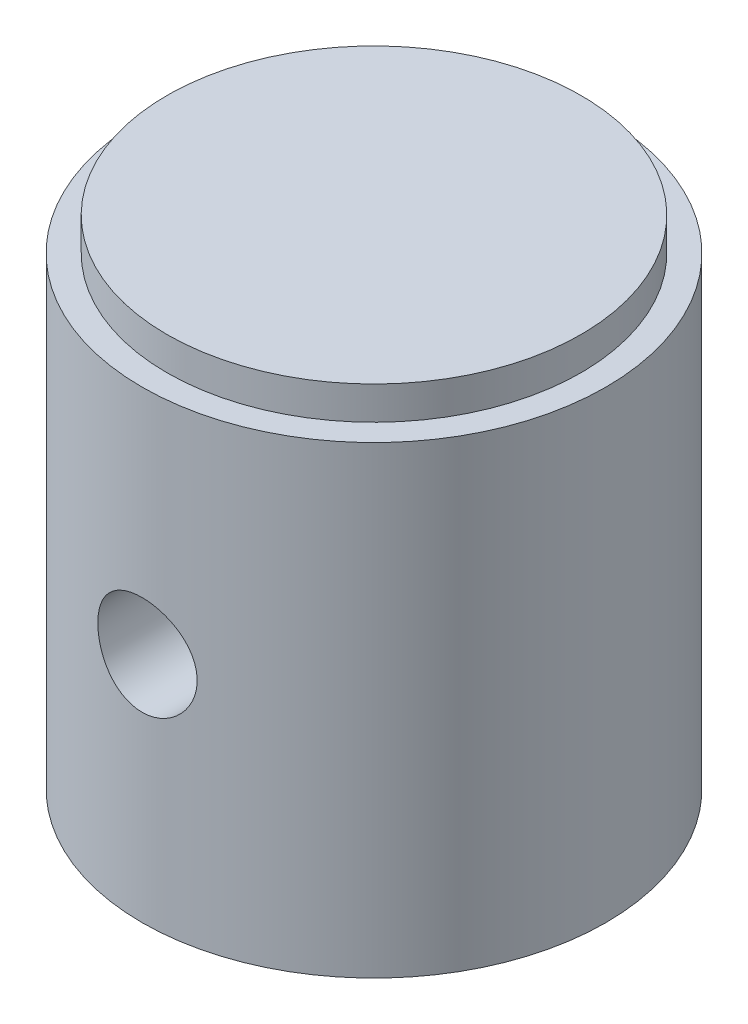
ISO-10303-21;
HEADER;
FILE_DESCRIPTION(('STEP AP214'),'2;1');
FILE_NAME('part.step','',(''),(''),'','','');
FILE_SCHEMA(('AUTOMOTIVE_DESIGN { 1 0 10303 214 1 1 1 1 }'));
ENDSEC;
DATA;
#1=APPLICATION_CONTEXT('core data for automotive mechanical design processes');
#2=APPLICATION_PROTOCOL_DEFINITION('international standard','automotive_design',2000,#1);
#3=PRODUCT_CONTEXT('',#1,'mechanical');
#4=PRODUCT('Part','Part','',(#3));
#5=PRODUCT_RELATED_PRODUCT_CATEGORY('part','',(#4));
#6=PRODUCT_DEFINITION_FORMATION('','',#4);
#7=PRODUCT_DEFINITION_CONTEXT('part definition',#1,'design');
#8=PRODUCT_DEFINITION('design','',#6,#7);
#9=PRODUCT_DEFINITION_SHAPE('','',#8);
#10=(LENGTH_UNIT() NAMED_UNIT(*) SI_UNIT(.MILLI.,.METRE.));
#11=(NAMED_UNIT(*) PLANE_ANGLE_UNIT() SI_UNIT($,.RADIAN.));
#12=(NAMED_UNIT(*) SI_UNIT($,.STERADIAN.) SOLID_ANGLE_UNIT());
#13=UNCERTAINTY_MEASURE_WITH_UNIT(LENGTH_MEASURE(1.E-05),#10,'distance_accuracy_value','');
#14=(GEOMETRIC_REPRESENTATION_CONTEXT(3) GLOBAL_UNCERTAINTY_ASSIGNED_CONTEXT((#13)) GLOBAL_UNIT_ASSIGNED_CONTEXT((#10,
#11,#12)) REPRESENTATION_CONTEXT('',''));
#15=CARTESIAN_POINT('',(0.,0.,0.));
#16=DIRECTION('',(0.,0.,1.));
#17=DIRECTION('',(1.,0.,0.));
#18=AXIS2_PLACEMENT_3D('',#15,#16,#17);
#19=CARTESIAN_POINT('',(0.,19.3671137438984,0.));
#20=DIRECTION('',(0.,1.,0.));
#21=DIRECTION('',(0.,0.,1.));
#22=AXIS2_PLACEMENT_3D('',#19,#20,#21);
#23=CYLINDRICAL_SURFACE('',#22,7.);
#24=CARTESIAN_POINT('',(0.,8.5,-7.));
#25=CARTESIAN_POINT('',(0.0832358860906166,8.4999971004257,-6.99999846043226));
#26=CARTESIAN_POINT('',(0.166507195600275,8.49304839161215,-6.9985002594971));
#27=CARTESIAN_POINT('',(0.330687344293327,8.46546434314641,-6.99266829827727));
#28=CARTESIAN_POINT('',(0.41159440357119,8.44481895580507,-6.98833245637099));
#29=CARTESIAN_POINT('',(0.568649323817737,8.39051563539196,-6.97730831788826));
#30=CARTESIAN_POINT('',(0.644801963446556,8.35687102061868,-6.97062242967171));
#31=CARTESIAN_POINT('',(0.790378177960788,8.27756591382874,-6.9556210681797));
#32=CARTESIAN_POINT('',(0.85980198174737,8.23190583075006,-6.9473056503666));
#33=CARTESIAN_POINT('',(0.99102479053523,8.12911970032649,-6.9298136924631));
#34=CARTESIAN_POINT('',(1.05270503419445,8.07184377810147,-6.92062683143259));
#35=CARTESIAN_POINT('',(1.16566042389435,7.9477736843148,-6.90250069814144));
#36=CARTESIAN_POINT('',(1.21693467150908,7.88097869174874,-6.8935614473163));
#37=CARTESIAN_POINT('',(1.30814204379808,7.73889424713957,-6.87684116047224));
#38=CARTESIAN_POINT('',(1.34794958335009,7.66352248224379,-6.8690733634436));
#39=CARTESIAN_POINT('',(1.41428823691148,7.50696554623316,-6.85572325558537));
#40=CARTESIAN_POINT('',(1.44082087001716,7.42578104150743,-6.8501406947071));
#41=CARTESIAN_POINT('',(1.47946574422454,7.26118891341193,-6.8418980892631));
#42=CARTESIAN_POINT('',(1.49178779748342,7.17783272433614,-6.83919556896486));
#43=CARTESIAN_POINT('',(1.50231395206577,7.01019576749301,-6.83689139845105));
#44=CARTESIAN_POINT('',(1.50051971664629,6.92591510982005,-6.83728938291729));
#45=CARTESIAN_POINT('',(1.48303326340861,6.76037531206621,-6.84110276603832));
#46=CARTESIAN_POINT('',(1.46758398649408,6.67908911089985,-6.84446541682162));
#47=CARTESIAN_POINT('',(1.42361054298677,6.52028975971066,-6.85374593375787));
#48=CARTESIAN_POINT('',(1.39508566936466,6.44277681396768,-6.85966393808402));
#49=CARTESIAN_POINT('',(1.32554551075991,6.29303712712666,-6.87344080755724));
#50=CARTESIAN_POINT('',(1.2844361097283,6.22085548728745,-6.88131420983364));
#51=CARTESIAN_POINT('',(1.19096007283993,6.08432483504204,-6.89810572501288));
#52=CARTESIAN_POINT('',(1.13859196103562,6.0199768513138,-6.90702397481896));
#53=CARTESIAN_POINT('',(1.0227954275532,5.8995406443266,-6.92512718393878));
#54=CARTESIAN_POINT('',(0.95916023396441,5.84365129341526,-6.93431383972177));
#55=CARTESIAN_POINT('',(0.823317306269096,5.74330626631034,-6.95175017497059));
#56=CARTESIAN_POINT('',(0.7511094287754,5.69885078139961,-6.95999983875972));
#57=CARTESIAN_POINT('',(0.59993346204996,5.62258932009307,-6.97465778534003));
#58=CARTESIAN_POINT('',(0.520952258863483,5.59080858742202,-6.98106238643354));
#59=CARTESIAN_POINT('',(0.358603146685707,5.54102435167892,-6.99128109245333));
#60=CARTESIAN_POINT('',(0.275235851133669,5.52301892743668,-6.99509555860383));
#61=CARTESIAN_POINT('',(0.10818767083663,5.50158378585658,-6.99965306347808));
#62=CARTESIAN_POINT('',(0.0245431772716154,5.49788228711822,-7.00045336521065));
#63=CARTESIAN_POINT('',(-0.142168973650404,5.50442457112516,-6.99905248935969));
#64=CARTESIAN_POINT('',(-0.225236668127254,5.51466744796294,-6.99685150675698));
#65=CARTESIAN_POINT('',(-0.387542537982805,5.5485822436617,-6.98973143045265));
#66=CARTESIAN_POINT('',(-0.466811712908477,5.57211236947253,-6.98484105045459));
#67=CARTESIAN_POINT('',(-0.620278450473417,5.63177694299482,-6.9728892442151));
#68=CARTESIAN_POINT('',(-0.694475592587739,5.66791243431165,-6.96582763822237));
#69=CARTESIAN_POINT('',(-0.836821397964753,5.75233354306033,-6.950175043904));
#70=CARTESIAN_POINT('',(-0.90487257511114,5.80077979490973,-6.94156431354275));
#71=CARTESIAN_POINT('',(-1.0319769255236,5.90823482488874,-6.92381033034847));
#72=CARTESIAN_POINT('',(-1.091028978692,5.96724491588744,-6.91466701142097));
#73=CARTESIAN_POINT('',(-1.19952711057989,6.09539737018714,-6.89668172706324));
#74=CARTESIAN_POINT('',(-1.24878537255156,6.1647000992221,-6.88784792221284));
#75=CARTESIAN_POINT('',(-1.3349641538604,6.31075459647799,-6.87166654559681));
#76=CARTESIAN_POINT('',(-1.37188519913706,6.38750604697749,-6.86431891048054));
#77=CARTESIAN_POINT('',(-1.43209741248548,6.5458722989946,-6.8520100980739));
#78=CARTESIAN_POINT('',(-1.45546398641275,6.62745735643067,-6.84703574582967));
#79=CARTESIAN_POINT('',(-1.48812696085335,6.79351558383364,-6.84001186708418));
#80=CARTESIAN_POINT('',(-1.49742550780258,6.87798831120132,-6.83796189439705));
#81=CARTESIAN_POINT('',(-1.5015999992604,7.04553234317524,-6.83704618848155));
#82=CARTESIAN_POINT('',(-1.49677347258311,7.12859601498058,-6.83811476518543));
#83=CARTESIAN_POINT('',(-1.47349789406331,7.29269724213259,-6.8431676318483));
#84=CARTESIAN_POINT('',(-1.45504898957979,7.37373481938657,-6.84715189026714));
#85=CARTESIAN_POINT('',(-1.40519345940434,7.53125865786917,-6.85755581104157));
#86=CARTESIAN_POINT('',(-1.37382847170887,7.60775864866429,-6.86396764224703));
#87=CARTESIAN_POINT('',(-1.29906751595601,7.75445537250685,-6.87850764590649));
#88=CARTESIAN_POINT('',(-1.255670353015,7.82465147861504,-6.88663598880362));
#89=CARTESIAN_POINT('',(-1.15708290349304,7.95821819372537,-6.90389055593232));
#90=CARTESIAN_POINT('',(-1.10167987421237,8.02142969594698,-6.91303309938926));
#91=CARTESIAN_POINT('',(-0.981086554619621,8.13775626252046,-6.93117449799694));
#92=CARTESIAN_POINT('',(-0.915894009385597,8.19086899431221,-6.94017331951296));
#93=CARTESIAN_POINT('',(-0.776603147268717,8.28611595950556,-6.95714491048987));
#94=CARTESIAN_POINT('',(-0.702404846009641,8.32810660623098,-6.96510364570626));
#95=CARTESIAN_POINT('',(-0.547850160940598,8.39895452890618,-6.97895826104019));
#96=CARTESIAN_POINT('',(-0.46749910586388,8.42782302258504,-6.98485590212342));
#97=CARTESIAN_POINT('',(-0.322535217553205,8.46635218513115,-6.99284848461771));
#98=CARTESIAN_POINT('',(-0.25871720554598,8.47894643398003,-6.99551391888263));
#99=CARTESIAN_POINT('',(-0.129939960853847,8.49577130171167,-6.99909024154719));
#100=CARTESIAN_POINT('',(-0.0649807750887451,8.50000226364606,-7.00000120191314));
#101=CARTESIAN_POINT('',(0.,8.5,-7.));
#102=B_SPLINE_CURVE_WITH_KNOTS('',3,(#24,#25,#26,#27,#28,#29,#30,#31,#32,#33,#34,#35,#36,#37,
#38,#39,#40,#41,#42,#43,#44,#45,#46,#47,#48,#49,#50,#51,#52,#53,#54,#55,#56,#57,#58,#59,#60,#61,
#62,#63,#64,#65,#66,#67,#68,#69,#70,#71,#72,#73,#74,#75,#76,#77,#78,#79,#80,#81,#82,#83,#84,#85,
#86,#87,#88,#89,#90,#91,#92,#93,#94,#95,#96,#97,#98,#99,#100,#101),.UNSPECIFIED.,.T.,.F.,(4,2,2,
2,2,2,2,2,2,2,2,2,2,2,2,2,2,2,2,2,2,2,2,2,2,2,2,2,2,2,2,2,2,2,2,2,2,2,4),(0.,0.249469836512082,
0.499122883219936,0.748520824425603,0.997910278645887,1.25074961881732,1.50361077918506,
1.7591442921451,2.0146485567749,2.26633008124666,2.51798195169165,2.76524475452928,
3.01252092904568,3.26169356165968,3.51089887920889,3.76527011050291,4.0196455970235,
4.27452521139806,4.52936927256343,4.77934665704185,5.02930780231429,5.27665060589267,
5.52401389198434,5.77478733867803,6.02559197304485,6.28082063283534,6.53603841075805,
6.78982240408475,7.04356767229185,7.29200680540294,7.5404432510827,7.78808499706785,
8.03575134451623,8.28822950154114,8.54076590397115,8.79641910357222,9.05185334010271,
9.24661799132294,9.44137465337336),.UNSPECIFIED.);
#103=CARTESIAN_POINT('',(0.,8.5,-7.));
#104=VERTEX_POINT('',#103);
#105=EDGE_CURVE('E90',#104,#104,#102,.T.);
#106=ORIENTED_EDGE('',*,*,#105,.F.);
#107=EDGE_LOOP('',(#106));
#108=FACE_BOUND('',#107,.T.);
#109=CARTESIAN_POINT('',(0.,5.5,7.));
#110=CARTESIAN_POINT('',(0.0832358860906166,5.5000028995743,6.99999846043225));
#111=CARTESIAN_POINT('',(0.166507195600275,5.50695160838786,6.9985002594971));
#112=CARTESIAN_POINT('',(0.330687344293327,5.53453565685359,6.99266829827727));
#113=CARTESIAN_POINT('',(0.41159440357119,5.55518104419493,6.98833245637099));
#114=CARTESIAN_POINT('',(0.568649323817737,5.60948436460804,6.97730831788826));
#115=CARTESIAN_POINT('',(0.644801963446556,5.64312897938132,6.97062242967171));
#116=CARTESIAN_POINT('',(0.790378177960787,5.72243408617126,6.9556210681797));
#117=CARTESIAN_POINT('',(0.859801981747369,5.76809416924994,6.9473056503666));
#118=CARTESIAN_POINT('',(0.991024790535229,5.87088029967351,6.9298136924631));
#119=CARTESIAN_POINT('',(1.05270503419445,5.92815622189853,6.92062683143259));
#120=CARTESIAN_POINT('',(1.16566042389435,6.0522263156852,6.90250069814144));
#121=CARTESIAN_POINT('',(1.21693467150908,6.11902130825126,6.8935614473163));
#122=CARTESIAN_POINT('',(1.30814204379809,6.26110575286043,6.87684116047224));
#123=CARTESIAN_POINT('',(1.34794958335009,6.33647751775621,6.8690733634436));
#124=CARTESIAN_POINT('',(1.41428823691148,6.49303445376684,6.85572325558537));
#125=CARTESIAN_POINT('',(1.44082087001716,6.57421895849257,6.85014069470711));
#126=CARTESIAN_POINT('',(1.47946574422454,6.73881108658807,6.8418980892631));
#127=CARTESIAN_POINT('',(1.49178779748342,6.82216727566387,6.83919556896486));
#128=CARTESIAN_POINT('',(1.50231395206577,6.989804232507,6.83689139845105));
#129=CARTESIAN_POINT('',(1.50051971664629,7.07408489017995,6.83728938291729));
#130=CARTESIAN_POINT('',(1.48303326340861,7.23962468793379,6.84110276603832));
#131=CARTESIAN_POINT('',(1.46758398649408,7.32091088910015,6.84446541682162));
#132=CARTESIAN_POINT('',(1.42361054298677,7.47971024028934,6.85374593375787));
#133=CARTESIAN_POINT('',(1.39508566936466,7.55722318603232,6.85966393808402));
#134=CARTESIAN_POINT('',(1.32554551075991,7.70696287287334,6.87344080755724));
#135=CARTESIAN_POINT('',(1.2844361097283,7.77914451271255,6.88131420983364));
#136=CARTESIAN_POINT('',(1.19096007283993,7.91567516495796,6.89810572501288));
#137=CARTESIAN_POINT('',(1.13859196103562,7.9800231486862,6.90702397481896));
#138=CARTESIAN_POINT('',(1.0227954275532,8.1004593556734,6.92512718393878));
#139=CARTESIAN_POINT('',(0.95916023396441,8.15634870658474,6.93431383972177));
#140=CARTESIAN_POINT('',(0.823317306269096,8.25669373368966,6.95175017497059));
#141=CARTESIAN_POINT('',(0.7511094287754,8.30114921860039,6.95999983875972));
#142=CARTESIAN_POINT('',(0.599933462049959,8.37741067990693,6.97465778534003));
#143=CARTESIAN_POINT('',(0.520952258863482,8.40919141257798,6.98106238643354));
#144=CARTESIAN_POINT('',(0.358603146685706,8.45897564832108,6.99128109245333));
#145=CARTESIAN_POINT('',(0.275235851133669,8.47698107256331,6.99509555860383));
#146=CARTESIAN_POINT('',(0.108187670836629,8.49841621414342,6.99965306347808));
#147=CARTESIAN_POINT('',(0.0245431772716145,8.50211771288178,7.00045336521065));
#148=CARTESIAN_POINT('',(-0.142168973650405,8.49557542887483,6.99905248935969));
#149=CARTESIAN_POINT('',(-0.225236668127255,8.48533255203706,6.99685150675698));
#150=CARTESIAN_POINT('',(-0.387542537982806,8.4514177563383,6.98973143045265));
#151=CARTESIAN_POINT('',(-0.466811712908477,8.42788763052747,6.98484105045459));
#152=CARTESIAN_POINT('',(-0.620278450473418,8.36822305700518,6.9728892442151));
#153=CARTESIAN_POINT('',(-0.69447559258774,8.33208756568835,6.96582763822237));
#154=CARTESIAN_POINT('',(-0.836821397964754,8.24766645693967,6.950175043904));
#155=CARTESIAN_POINT('',(-0.904872575111141,8.19922020509027,6.94156431354275));
#156=CARTESIAN_POINT('',(-1.0319769255236,8.09176517511126,6.92381033034847));
#157=CARTESIAN_POINT('',(-1.091028978692,8.03275508411256,6.91466701142097));
#158=CARTESIAN_POINT('',(-1.19952711057989,7.90460262981286,6.89668172706324));
#159=CARTESIAN_POINT('',(-1.24878537255156,7.8352999007779,6.88784792221284));
#160=CARTESIAN_POINT('',(-1.3349641538604,7.68924540352201,6.87166654559681));
#161=CARTESIAN_POINT('',(-1.37188519913706,7.61249395302251,6.86431891048054));
#162=CARTESIAN_POINT('',(-1.43209741248548,7.4541277010054,6.8520100980739));
#163=CARTESIAN_POINT('',(-1.45546398641275,7.37254264356933,6.84703574582967));
#164=CARTESIAN_POINT('',(-1.48812696085335,7.20648441616636,6.84001186708418));
#165=CARTESIAN_POINT('',(-1.49742550780258,7.12201168879868,6.83796189439705));
#166=CARTESIAN_POINT('',(-1.5015999992604,6.95446765682476,6.83704618848155));
#167=CARTESIAN_POINT('',(-1.49677347258311,6.87140398501942,6.83811476518543));
#168=CARTESIAN_POINT('',(-1.47349789406331,6.70730275786741,6.8431676318483));
#169=CARTESIAN_POINT('',(-1.45504898957979,6.62626518061343,6.84715189026714));
#170=CARTESIAN_POINT('',(-1.40519345940434,6.46874134213083,6.85755581104157));
#171=CARTESIAN_POINT('',(-1.37382847170887,6.39224135133571,6.86396764224703));
#172=CARTESIAN_POINT('',(-1.29906751595601,6.24554462749315,6.87850764590649));
#173=CARTESIAN_POINT('',(-1.255670353015,6.17534852138496,6.88663598880362));
#174=CARTESIAN_POINT('',(-1.15708290349304,6.04178180627463,6.90389055593232));
#175=CARTESIAN_POINT('',(-1.10167987421237,5.97857030405302,6.91303309938926));
#176=CARTESIAN_POINT('',(-0.981086554619621,5.86224373747954,6.93117449799694));
#177=CARTESIAN_POINT('',(-0.915894009385597,5.80913100568779,6.94017331951296));
#178=CARTESIAN_POINT('',(-0.776603147268717,5.71388404049444,6.95714491048987));
#179=CARTESIAN_POINT('',(-0.702404846009641,5.67189339376902,6.96510364570626));
#180=CARTESIAN_POINT('',(-0.547850160940598,5.60104547109382,6.97895826104019));
#181=CARTESIAN_POINT('',(-0.46749910586388,5.57217697741496,6.98485590212342));
#182=CARTESIAN_POINT('',(-0.322535217553205,5.53364781486885,6.99284848461771));
#183=CARTESIAN_POINT('',(-0.25871720554598,5.52105356601997,6.99551391888263));
#184=CARTESIAN_POINT('',(-0.129939960853847,5.50422869828833,6.99909024154719));
#185=CARTESIAN_POINT('',(-0.0649807750887451,5.49999773635394,7.00000120191314));
#186=CARTESIAN_POINT('',(0.,5.5,7.));
#187=B_SPLINE_CURVE_WITH_KNOTS('',3,(#109,#110,#111,#112,#113,#114,#115,#116,#117,#118,#119,
#120,#121,#122,#123,#124,#125,#126,#127,#128,#129,#130,#131,#132,#133,#134,#135,#136,#137,#138,
#139,#140,#141,#142,#143,#144,#145,#146,#147,#148,#149,#150,#151,#152,#153,#154,#155,#156,#157,
#158,#159,#160,#161,#162,#163,#164,#165,#166,#167,#168,#169,#170,#171,#172,#173,#174,#175,#176,
#177,#178,#179,#180,#181,#182,#183,#184,#185,#186),.UNSPECIFIED.,.T.,.F.,(4,2,2,2,2,2,2,2,2,2,2,
2,2,2,2,2,2,2,2,2,2,2,2,2,2,2,2,2,2,2,2,2,2,2,2,2,2,2,4),(0.,0.249469836512082,
0.499122883219936,0.748520824425602,0.997910278645887,1.25074961881732,1.50361077918506,
1.7591442921451,2.0146485567749,2.26633008124666,2.51798195169165,2.76524475452928,
3.01252092904568,3.26169356165968,3.51089887920889,3.76527011050291,4.0196455970235,
4.27452521139806,4.52936927256343,4.77934665704185,5.02930780231429,5.27665060589267,
5.52401389198434,5.77478733867803,6.02559197304485,6.28082063283534,6.53603841075805,
6.78982240408475,7.04356767229185,7.29200680540294,7.5404432510827,7.78808499706785,
8.03575134451623,8.28822950154114,8.54076590397115,8.79641910357222,9.05185334010271,
9.24661799132294,9.44137465337336),.UNSPECIFIED.);
#188=CARTESIAN_POINT('',(0.,5.5,7.));
#189=VERTEX_POINT('',#188);
#190=EDGE_CURVE('E95',#189,#189,#187,.T.);
#191=ORIENTED_EDGE('',*,*,#190,.F.);
#192=EDGE_LOOP('',(#191));
#193=FACE_BOUND('',#192,.T.);
#194=CARTESIAN_POINT('',(0.,0.,0.));
#195=DIRECTION('',(0.,1.,0.));
#196=DIRECTION('',(0.,0.,1.));
#197=AXIS2_PLACEMENT_3D('',#194,#195,#196);
#198=CIRCLE('',#197,7.);
#199=CARTESIAN_POINT('',(0.,0.,7.));
#200=VERTEX_POINT('',#199);
#201=EDGE_CURVE('E101',#200,#200,#198,.T.);
#202=ORIENTED_EDGE('',*,*,#201,.T.);
#203=EDGE_LOOP('',(#202));
#204=FACE_BOUND('',#203,.T.);
#205=CARTESIAN_POINT('',(0.,14.,0.));
#206=DIRECTION('',(0.,1.,0.));
#207=DIRECTION('',(0.,0.,1.));
#208=AXIS2_PLACEMENT_3D('',#205,#206,#207);
#209=CIRCLE('',#208,7.);
#210=CARTESIAN_POINT('',(0.,14.,7.));
#211=VERTEX_POINT('',#210);
#212=EDGE_CURVE('E11',#211,#211,#209,.T.);
#213=ORIENTED_EDGE('',*,*,#212,.F.);
#214=EDGE_LOOP('',(#213));
#215=FACE_BOUND('',#214,.T.);
#216=ADVANCED_FACE('F33',(#108,#193,#204,#215),#23,.T.);
#217=CARTESIAN_POINT('',(-7.,14.,0.));
#218=DIRECTION('',(0.,1.,0.));
#219=DIRECTION('',(0.,0.,1.));
#220=AXIS2_PLACEMENT_3D('',#217,#218,#219);
#221=PLANE('',#220);
#222=ORIENTED_EDGE('',*,*,#212,.T.);
#223=EDGE_LOOP('',(#222));
#224=FACE_BOUND('',#223,.T.);
#225=CARTESIAN_POINT('',(0.,14.,0.));
#226=DIRECTION('',(0.,1.,0.));
#227=DIRECTION('',(0.,0.,1.));
#228=AXIS2_PLACEMENT_3D('',#225,#226,#227);
#229=CIRCLE('',#228,6.25);
#230=CARTESIAN_POINT('',(0.,14.,6.25));
#231=VERTEX_POINT('',#230);
#232=EDGE_CURVE('E46',#231,#231,#229,.T.);
#233=ORIENTED_EDGE('',*,*,#232,.F.);
#234=EDGE_LOOP('',(#233));
#235=FACE_BOUND('',#234,.T.);
#236=ADVANCED_FACE('F117',(#224,#235),#221,.T.);
#237=CARTESIAN_POINT('',(0.,19.3671137438984,0.));
#238=DIRECTION('',(0.,1.,0.));
#239=DIRECTION('',(0.,0.,1.));
#240=AXIS2_PLACEMENT_3D('',#237,#238,#239);
#241=CYLINDRICAL_SURFACE('',#240,6.25);
#242=ORIENTED_EDGE('',*,*,#232,.T.);
#243=EDGE_LOOP('',(#242));
#244=FACE_BOUND('',#243,.T.);
#245=CARTESIAN_POINT('',(0.,15.,0.));
#246=DIRECTION('',(0.,1.,0.));
#247=DIRECTION('',(0.,0.,1.));
#248=AXIS2_PLACEMENT_3D('',#245,#246,#247);
#249=CIRCLE('',#248,6.25);
#250=CARTESIAN_POINT('',(0.,15.,6.25));
#251=VERTEX_POINT('',#250);
#252=EDGE_CURVE('E60',#251,#251,#249,.T.);
#253=ORIENTED_EDGE('',*,*,#252,.F.);
#254=EDGE_LOOP('',(#253));
#255=FACE_BOUND('',#254,.T.);
#256=ADVANCED_FACE('F122',(#244,#255),#241,.T.);
#257=CARTESIAN_POINT('',(-6.25,15.,0.));
#258=DIRECTION('',(0.,1.,0.));
#259=DIRECTION('',(0.,0.,1.));
#260=AXIS2_PLACEMENT_3D('',#257,#258,#259);
#261=PLANE('',#260);
#262=ORIENTED_EDGE('',*,*,#252,.T.);
#263=EDGE_LOOP('',(#262));
#264=FACE_BOUND('',#263,.T.);
#265=ADVANCED_FACE('F54',(#264),#261,.T.);
#266=CARTESIAN_POINT('',(0.,11.,0.));
#267=DIRECTION('',(0.,-1.,0.));
#268=DIRECTION('',(0.,0.,-1.));
#269=AXIS2_PLACEMENT_3D('',#266,#267,#268);
#270=CONICAL_SURFACE('',#269,4.75,1.02974425867665);
#271=CARTESIAN_POINT('',(0.,13.8540879403809,0.));
#272=VERTEX_POINT('',#271);
#273=VERTEX_LOOP('',#272);
#274=FACE_BOUND('',#273,.T.);
#275=CARTESIAN_POINT('',(0.,11.,0.));
#276=DIRECTION('',(0.,1.,0.));
#277=DIRECTION('',(0.,0.,1.));
#278=AXIS2_PLACEMENT_3D('',#275,#276,#277);
#279=CIRCLE('',#278,4.75);
#280=CARTESIAN_POINT('',(0.,11.,4.75));
#281=VERTEX_POINT('',#280);
#282=EDGE_CURVE('E58',#281,#281,#279,.T.);
#283=ORIENTED_EDGE('',*,*,#282,.F.);
#284=EDGE_LOOP('',(#283));
#285=FACE_BOUND('',#284,.T.);
#286=ADVANCED_FACE('F50',(#274,#285),#270,.F.);
#287=CARTESIAN_POINT('',(0.,19.3671137438984,0.));
#288=DIRECTION('',(0.,1.,0.));
#289=DIRECTION('',(0.,0.,1.));
#290=AXIS2_PLACEMENT_3D('',#287,#288,#289);
#291=CYLINDRICAL_SURFACE('',#290,4.75);
#292=CARTESIAN_POINT('',(0.,5.5,4.75));
#293=CARTESIAN_POINT('',(-0.0820835447314043,5.5000004039971,4.74999967904615));
#294=CARTESIAN_POINT('',(-0.164171496501827,5.50675986949461,4.74785228936723));
#295=CARTESIAN_POINT('',(-0.325944116631497,5.53354644922318,4.73949648091444));
#296=CARTESIAN_POINT('',(-0.405628283459122,5.55357631247727,4.73328722070904));
#297=CARTESIAN_POINT('',(-0.560237269504344,5.60615895618401,4.71748543187023));
#298=CARTESIAN_POINT('',(-0.63516933409095,5.63869211110696,4.7078982073406));
#299=CARTESIAN_POINT('',(-0.778514579207214,5.71527353642869,4.68632862599565));
#300=CARTESIAN_POINT('',(-0.846926688392995,5.75932369483844,4.67434587655187));
#301=CARTESIAN_POINT('',(-0.977443078754499,5.85914733742643,4.64883376662147));
#302=CARTESIAN_POINT('',(-1.03931346588882,5.91521784873678,4.63527018347254));
#303=CARTESIAN_POINT('',(-1.15294742613925,6.03685828012277,4.60832176901776));
#304=CARTESIAN_POINT('',(-1.2047090669501,6.10243001220941,4.5949369723419));
#305=CARTESIAN_POINT('',(-1.29793466853577,6.24324878211588,4.56949296853185));
#306=CARTESIAN_POINT('',(-1.33910462019172,6.31869880344415,4.55747591989588));
#307=CARTESIAN_POINT('',(-1.40807389327236,6.47589246177624,4.53664362085522));
#308=CARTESIAN_POINT('',(-1.4358768216778,6.55763439404534,4.52782750686213));
#309=CARTESIAN_POINT('',(-1.47646364106285,6.72244890236944,4.51475360613692));
#310=CARTESIAN_POINT('',(-1.48968210274354,6.8054037344088,4.51036428133252));
#311=CARTESIAN_POINT('',(-1.50208257395981,6.97246089821985,4.50625061102434));
#312=CARTESIAN_POINT('',(-1.50126840605207,7.05656291125655,4.50652499510326));
#313=CARTESIAN_POINT('',(-1.48596623804714,7.2199155188389,4.51159176137022));
#314=CARTESIAN_POINT('',(-1.47203288124122,7.29922471624083,4.51620087396631));
#315=CARTESIAN_POINT('',(-1.43178798005592,7.4543165274426,4.52911970742075));
#316=CARTESIAN_POINT('',(-1.40547509472982,7.53009875822503,4.53742982916608));
#317=CARTESIAN_POINT('',(-1.34083084084602,7.67729726787565,4.55695325959034));
#318=CARTESIAN_POINT('',(-1.30232683858134,7.74863202315481,4.56820783899944));
#319=CARTESIAN_POINT('',(-1.21451321691615,7.88400882434957,4.59233341866295));
#320=CARTESIAN_POINT('',(-1.16520074091948,7.94804893553449,4.60520484585311));
#321=CARTESIAN_POINT('',(-1.05445721763047,8.0701513614985,4.63184688202887));
#322=CARTESIAN_POINT('',(-0.992568961591257,8.12779672907412,4.64563145900086));
#323=CARTESIAN_POINT('',(-0.859832533931192,8.2319932402701,4.67201892608795));
#324=CARTESIAN_POINT('',(-0.788983670789579,8.27854352684441,4.68462172487032));
#325=CARTESIAN_POINT('',(-0.639521244304237,8.35951904447478,4.70736283385871));
#326=CARTESIAN_POINT('',(-0.560849403229559,8.3938429460244,4.71748034190943));
#327=CARTESIAN_POINT('',(-0.398454273025005,8.44864477780197,4.73396063106369));
#328=CARTESIAN_POINT('',(-0.314732560358457,8.46912700498974,4.74032457733139));
#329=CARTESIAN_POINT('',(-0.148151942001062,8.49494945913915,4.74839235389519));
#330=CARTESIAN_POINT('',(-0.0653887879529902,8.50085396580235,4.75026975398177));
#331=CARTESIAN_POINT('',(0.0999556894804201,8.49894688258363,4.74966735792893));
#332=CARTESIAN_POINT('',(0.182537038204382,8.49113734353799,4.74718821327919));
#333=CARTESIAN_POINT('',(0.342984606452105,8.46247591011593,4.73826543461407));
#334=CARTESIAN_POINT('',(0.420917353280694,8.44196140872058,4.73192442641254));
#335=CARTESIAN_POINT('',(0.572211571751271,8.38888562686362,4.71602217273612));
#336=CARTESIAN_POINT('',(0.645572474036246,8.35632284945278,4.70646052712339));
#337=CARTESIAN_POINT('',(0.787656381223484,8.27917690993629,4.68480447515659));
#338=CARTESIAN_POINT('',(0.856220098995369,8.23431674292693,4.67265334948307));
#339=CARTESIAN_POINT('',(0.985034898254589,8.13418067887393,4.64720609363859));
#340=CARTESIAN_POINT('',(1.04528367215737,8.07890190045923,4.63390964727142));
#341=CARTESIAN_POINT('',(1.15829337789972,7.95684340325735,4.60699149316922));
#342=CARTESIAN_POINT('',(1.21065200367447,7.88968843942855,4.593378435549));
#343=CARTESIAN_POINT('',(1.3033950666371,7.74724996145659,4.5679297313532));
#344=CARTESIAN_POINT('',(1.34377965554056,7.67196655032041,4.55609406225838));
#345=CARTESIAN_POINT('',(1.41118548758715,7.51553805111937,4.53566962908159));
#346=CARTESIAN_POINT('',(1.43825519702983,7.43441547307574,4.52706911631109));
#347=CARTESIAN_POINT('',(1.47824972090378,7.26843519987737,4.5141696846939));
#348=CARTESIAN_POINT('',(1.49118006577835,7.18357897861189,4.50986908404445));
#349=CARTESIAN_POINT('',(1.50212620605735,7.0167530740698,4.50623416787646));
#350=CARTESIAN_POINT('',(1.50080314084641,6.93483104000155,4.50667969384457));
#351=CARTESIAN_POINT('',(1.48488083195079,6.77243834211374,4.51195053556041));
#352=CARTESIAN_POINT('',(1.47028223238921,6.6919676080709,4.51677563881295));
#353=CARTESIAN_POINT('',(1.42866989928935,6.53597152921748,4.53010652438159));
#354=CARTESIAN_POINT('',(1.40184917312304,6.46038942721165,4.53855497041869));
#355=CARTESIAN_POINT('',(1.33670650315647,6.3147380042112,4.55816492249634));
#356=CARTESIAN_POINT('',(1.29838218467217,6.24466982522753,4.56932698861838));
#357=CARTESIAN_POINT('',(1.2095354013046,6.10901325470247,4.59366117792159));
#358=CARTESIAN_POINT('',(1.15858784628932,6.0437144917316,4.60689565835744));
#359=CARTESIAN_POINT('',(1.0466842406539,5.92237916236931,4.63360081206468));
#360=CARTESIAN_POINT('',(0.985725490335815,5.86634510257287,4.64707154816902));
#361=CARTESIAN_POINT('',(0.85306632642395,5.76324307569491,4.67327443028954));
#362=CARTESIAN_POINT('',(0.781073823515225,5.71653960927033,4.68596655437371));
#363=CARTESIAN_POINT('',(0.629859472842859,5.63595831562901,4.70867379243004));
#364=CARTESIAN_POINT('',(0.550640331972044,5.60207571036542,4.71868990328235));
#365=CARTESIAN_POINT('',(0.393635914977816,5.55040123089677,4.7342664308075));
#366=CARTESIAN_POINT('',(0.316225133186438,5.53155612041441,4.74011460510933));
#367=CARTESIAN_POINT('',(0.159210635950566,5.50635663733556,4.7479811380776));
#368=CARTESIAN_POINT('',(0.0796073905560846,5.49999960818998,4.75000031127187));
#369=CARTESIAN_POINT('',(0.,5.5,4.75));
#370=B_SPLINE_CURVE_WITH_KNOTS('',3,(#292,#293,#294,#295,#296,#297,#298,#299,#300,#301,#302,
#303,#304,#305,#306,#307,#308,#309,#310,#311,#312,#313,#314,#315,#316,#317,#318,#319,#320,#321,
#322,#323,#324,#325,#326,#327,#328,#329,#330,#331,#332,#333,#334,#335,#336,#337,#338,#339,#340,
#341,#342,#343,#344,#345,#346,#347,#348,#349,#350,#351,#352,#353,#354,#355,#356,#357,#358,#359,
#360,#361,#362,#363,#364,#365,#366,#367,#368,#369),.UNSPECIFIED.,.T.,.F.,(4,2,2,2,2,2,2,2,2,2,2,
2,2,2,2,2,2,2,2,2,2,2,2,2,2,2,2,2,2,2,2,2,2,2,2,2,2,2,4),(0.,0.24595797085269,0.491966908951221,
0.737591271008995,0.983255924152799,1.23588716608584,1.4885666517754,1.74764569043262,
2.00665477945945,2.25771831624514,2.50871346318116,2.74955211816805,2.99041686673246,
3.23485763830864,3.47936309176113,3.7352484740648,3.99115361598384,4.24913282924923,
4.50703191953741,4.75477968540458,5.00249040554177,5.24388939060298,5.48531837858214,
5.73270991189647,5.98016996447342,6.23765665880273,6.49514009053908,6.75167921313646,
7.00811795759371,7.25271509638717,7.49730036806766,7.73815036093371,7.97905010664366,
8.22954585775127,8.48010927077556,8.73909121554316,8.99797654827696,9.23656564494835,
9.47510398183575),.UNSPECIFIED.);
#371=CARTESIAN_POINT('',(0.,5.5,4.75));
#372=VERTEX_POINT('',#371);
#373=EDGE_CURVE('E37',#372,#372,#370,.T.);
#374=ORIENTED_EDGE('',*,*,#373,.F.);
#375=EDGE_LOOP('',(#374));
#376=FACE_BOUND('',#375,.T.);
#377=CARTESIAN_POINT('',(1.5,7.,-4.50693909432998));
#378=CARTESIAN_POINT('',(1.49999958004515,7.08196828267614,-4.50693949515468));
#379=CARTESIAN_POINT('',(1.49325840231682,7.16394098372474,-4.50919970874085));
#380=CARTESIAN_POINT('',(1.46655104887094,7.32547500949945,-4.5179553253781));
#381=CARTESIAN_POINT('',(1.44658152131253,7.40503571772268,-4.52445180182027));
#382=CARTESIAN_POINT('',(1.39417508352591,7.55938220284953,-4.54087234787262));
#383=CARTESIAN_POINT('',(1.36176059537411,7.63417628681151,-4.55079024986066));
#384=CARTESIAN_POINT('',(1.28545946652237,7.77728605600465,-4.57292751994247));
#385=CARTESIAN_POINT('',(1.24157071835092,7.84560054798797,-4.58514731070763));
#386=CARTESIAN_POINT('',(1.14191784971278,7.97620867145206,-4.6109923380212));
#387=CARTESIAN_POINT('',(1.08582030493755,8.03824156373591,-4.62464992232587));
#388=CARTESIAN_POINT('',(0.964055421977067,8.15219435282351,-4.65155671093151));
#389=CARTESIAN_POINT('',(0.898386720233771,8.20411280620364,-4.66480585671777));
#390=CARTESIAN_POINT('',(0.757464836701735,8.29751850612538,-4.68977365915903));
#391=CARTESIAN_POINT('',(0.682025001056138,8.33873651170335,-4.70144979545653));
#392=CARTESIAN_POINT('',(0.524852067423557,8.40779725722458,-4.72157773016224));
#393=CARTESIAN_POINT('',(0.443120487221092,8.43564321130615,-4.73003030329318));
#394=CARTESIAN_POINT('',(0.278414775826808,8.47629673110112,-4.74252974850081));
#395=CARTESIAN_POINT('',(0.195560751143444,8.48955010145606,-4.74670693307633));
#396=CARTESIAN_POINT('',(0.0287067286102965,8.50205550409757,-4.75064554540297));
#397=CARTESIAN_POINT('',(-0.0552929988694207,8.50131078451008,-4.75040799755164));
#398=CARTESIAN_POINT('',(-0.218913619351864,8.48613280044412,-4.74563427350171));
#399=CARTESIAN_POINT('',(-0.298584494979865,8.47218295028315,-4.74124990899214));
#400=CARTESIAN_POINT('',(-0.454390311754809,8.43178484234958,-4.72886249486103));
#401=CARTESIAN_POINT('',(-0.530525020335841,8.40533576380501,-4.72085920760149));
#402=CARTESIAN_POINT('',(-0.678203652675078,8.34038381811517,-4.7019310355991));
#403=CARTESIAN_POINT('',(-0.749679013295809,8.30173567232402,-4.69097118266662));
#404=CARTESIAN_POINT('',(-0.885279102378908,8.21359968541286,-4.66728249867119));
#405=CARTESIAN_POINT('',(-0.949401935733848,8.16410905917775,-4.65455321340063));
#406=CARTESIAN_POINT('',(-1.07135837440922,8.05321803376508,-4.62803989727125));
#407=CARTESIAN_POINT('',(-1.12880871974839,7.99140076594742,-4.61423403233704));
#408=CARTESIAN_POINT('',(-1.23264301054731,7.85888184102085,-4.58758892442481));
#409=CARTESIAN_POINT('',(-1.2790255944206,7.7881790924274,-4.57474980051078));
#410=CARTESIAN_POINT('',(-1.35986638692084,7.63879322816875,-4.55138024059369));
#411=CARTESIAN_POINT('',(-1.39417963639867,7.5600268613839,-4.54087839223385));
#412=CARTESIAN_POINT('',(-1.44893342452635,7.39742189828439,-4.5237069894911));
#413=CARTESIAN_POINT('',(-1.46937907304313,7.31358518268336,-4.5170360236621));
#414=CARTESIAN_POINT('',(-1.49507161979024,7.14689763967609,-4.5085959379324));
#415=CARTESIAN_POINT('',(-1.50090655288536,7.06414699632123,-4.50663729609298));
#416=CARTESIAN_POINT('',(-1.49886513965521,6.89884228403352,-4.50731687465407));
#417=CARTESIAN_POINT('',(-1.49099096720734,6.81628818601273,-4.50995436623754));
#418=CARTESIAN_POINT('',(-1.46228084598242,6.65627331210253,-4.51934163323601));
#419=CARTESIAN_POINT('',(-1.4418371919129,6.57873407933305,-4.5259668251803));
#420=CARTESIAN_POINT('',(-1.38903056686353,6.42819606752119,-4.54245022183902));
#421=CARTESIAN_POINT('',(-1.35666562487664,6.35519804163378,-4.55230896114271));
#422=CARTESIAN_POINT('',(-1.2798587413425,6.21345829627849,-4.57450539166733));
#423=CARTESIAN_POINT('',(-1.2350921421442,6.14490277172614,-4.58690698850856));
#424=CARTESIAN_POINT('',(-1.13512998682984,6.01606295424143,-4.61266077618539));
#425=CARTESIAN_POINT('',(-1.07993166463933,5.9557808624266,-4.62601321856053));
#426=CARTESIAN_POINT('',(-0.957886037531119,5.84255822339201,-4.65285013455169));
#427=CARTESIAN_POINT('',(-0.890643665109767,5.79003801711159,-4.66631614662306));
#428=CARTESIAN_POINT('',(-0.747973360630616,5.69700869180867,-4.6912975579683));
#429=CARTESIAN_POINT('',(-0.672545793179843,5.65649903807951,-4.70281304406929));
#430=CARTESIAN_POINT('',(-0.516099288450846,5.58902763746837,-4.72253168708172));
#431=CARTESIAN_POINT('',(-0.435125281433141,5.56196896821548,-4.73075845435933));
#432=CARTESIAN_POINT('',(-0.269469399491866,5.521946955657,-4.7430763734001));
#433=CARTESIAN_POINT('',(-0.18478872100236,5.50897909853475,-4.74716884950256));
#434=CARTESIAN_POINT('',(-0.0179886485878237,5.49787969673414,-4.7506674317259));
#435=CARTESIAN_POINT('',(0.064086836153865,5.49914159728498,-4.75026513795577));
#436=CARTESIAN_POINT('',(0.226803220963033,5.51499454533605,-4.74528029002945));
#437=CARTESIAN_POINT('',(0.307444217580877,5.52958469227172,-4.74069801830655));
#438=CARTESIAN_POINT('',(0.463969836764499,5.57129105994288,-4.72793024704182));
#439=CARTESIAN_POINT('',(0.539902672774311,5.5982419327476,-4.71979237633648));
#440=CARTESIAN_POINT('',(0.686204345183072,5.66375485659461,-4.70075227796056));
#441=CARTESIAN_POINT('',(0.756572215112847,5.70231891893586,-4.68984957149724));
#442=CARTESIAN_POINT('',(0.892382156713933,5.79149731947347,-4.66594837362514));
#443=CARTESIAN_POINT('',(0.957571386267192,5.84248067140566,-4.65289067194133));
#444=CARTESIAN_POINT('',(1.07867009763973,5.95440321249846,-4.62631837968684));
#445=CARTESIAN_POINT('',(1.13457676425287,6.01534541088941,-4.61280365200012));
#446=CARTESIAN_POINT('',(1.23744612372159,6.14794144277214,-4.58630016066439));
#447=CARTESIAN_POINT('',(1.28403955823579,6.21988929825807,-4.5733449634976));
#448=CARTESIAN_POINT('',(1.36442560849337,6.37098605672067,-4.55001145096037));
#449=CARTESIAN_POINT('',(1.39822313048985,6.45013218524502,-4.5396321484584));
#450=CARTESIAN_POINT('',(1.44974900503547,6.60694645257124,-4.52342799882925));
#451=CARTESIAN_POINT('',(1.46853682069789,6.6842364458579,-4.51730787458817));
#452=CARTESIAN_POINT('',(1.4936609032698,6.84101662585257,-4.50906374742014));
#453=CARTESIAN_POINT('',(1.50000040727695,6.92050623511172,-4.50693870560567));
#454=CARTESIAN_POINT('',(1.5,7.,-4.50693909432998));
#455=B_SPLINE_CURVE_WITH_KNOTS('',3,(#377,#378,#379,#380,#381,#382,#383,#384,#385,#386,#387,
#388,#389,#390,#391,#392,#393,#394,#395,#396,#397,#398,#399,#400,#401,#402,#403,#404,#405,#406,
#407,#408,#409,#410,#411,#412,#413,#414,#415,#416,#417,#418,#419,#420,#421,#422,#423,#424,#425,
#426,#427,#428,#429,#430,#431,#432,#433,#434,#435,#436,#437,#438,#439,#440,#441,#442,#443,#444,
#445,#446,#447,#448,#449,#450,#451,#452,#453,#454),.UNSPECIFIED.,.T.,.F.,(4,2,2,2,2,2,2,2,2,2,2,
2,2,2,2,2,2,2,2,2,2,2,2,2,2,2,2,2,2,2,2,2,2,2,2,2,2,2,4),(0.,0.245611090579273,
0.491284438685785,0.736517218845767,0.981795072467574,1.23487733964253,1.48799569757339,
1.74697244897189,2.00588692090239,2.25665093580603,2.50735676398231,2.74922580012767,
2.99111072100683,3.2359924360223,3.48093712787276,3.7362950135404,3.99168429786021,
4.25004385973256,4.50830817072249,4.75599786818586,5.00364829262799,5.24393641423545,
5.48426428174336,5.7316004031664,5.97900220045884,6.23690747266809,6.49480126127746,
6.75080881416402,7.0067343340116,7.25179355317672,7.49683621537552,7.73869250201122,
7.98059070007259,8.23081327027949,8.48111158966216,8.739930558781,8.99865018989115,
9.23690856092584,9.47510496630383),.UNSPECIFIED.);
#456=CARTESIAN_POINT('',(1.5,7.,-4.50693909432998));
#457=VERTEX_POINT('',#456);
#458=EDGE_CURVE('E71',#457,#457,#455,.T.);
#459=ORIENTED_EDGE('',*,*,#458,.F.);
#460=EDGE_LOOP('',(#459));
#461=FACE_BOUND('',#460,.T.);
#462=ORIENTED_EDGE('',*,*,#282,.T.);
#463=EDGE_LOOP('',(#462));
#464=FACE_BOUND('',#463,.T.);
#465=CARTESIAN_POINT('',(0.,4.12121612918192,0.));
#466=DIRECTION('',(0.,1.,0.));
#467=DIRECTION('',(0.,0.,1.));
#468=AXIS2_PLACEMENT_3D('',#465,#466,#467);
#469=CIRCLE('',#468,4.75);
#470=CARTESIAN_POINT('',(0.,4.12121612918192,4.75));
#471=VERTEX_POINT('',#470);
#472=EDGE_CURVE('E61',#471,#471,#469,.T.);
#473=ORIENTED_EDGE('',*,*,#472,.F.);
#474=EDGE_LOOP('',(#473));
#475=FACE_BOUND('',#474,.T.);
#476=ADVANCED_FACE('F53',(#376,#461,#464,#475),#291,.F.);
#477=CARTESIAN_POINT('',(0.,0.,0.));
#478=DIRECTION('',(0.,-1.,0.));
#479=DIRECTION('',(0.,0.,-1.));
#480=AXIS2_PLACEMENT_3D('',#477,#478,#479);
#481=CONICAL_SURFACE('',#480,6.25,0.349065850398867);
#482=ORIENTED_EDGE('',*,*,#472,.T.);
#483=EDGE_LOOP('',(#482));
#484=FACE_BOUND('',#483,.T.);
#485=CARTESIAN_POINT('',(0.,0.,0.));
#486=DIRECTION('',(0.,1.,0.));
#487=DIRECTION('',(0.,0.,1.));
#488=AXIS2_PLACEMENT_3D('',#485,#486,#487);
#489=CIRCLE('',#488,6.25);
#490=CARTESIAN_POINT('',(0.,0.,6.25));
#491=VERTEX_POINT('',#490);
#492=EDGE_CURVE('E66',#491,#491,#489,.T.);
#493=ORIENTED_EDGE('',*,*,#492,.F.);
#494=EDGE_LOOP('',(#493));
#495=FACE_BOUND('',#494,.T.);
#496=ADVANCED_FACE('F108',(#484,#495),#481,.F.);
#497=CARTESIAN_POINT('',(-7.,0.,0.));
#498=DIRECTION('',(0.,-1.,0.));
#499=DIRECTION('',(0.,0.,-1.));
#500=AXIS2_PLACEMENT_3D('',#497,#498,#499);
#501=PLANE('',#500);
#502=ORIENTED_EDGE('',*,*,#492,.T.);
#503=EDGE_LOOP('',(#502));
#504=FACE_BOUND('',#503,.T.);
#505=ORIENTED_EDGE('',*,*,#201,.F.);
#506=EDGE_LOOP('',(#505));
#507=FACE_BOUND('',#506,.T.);
#508=ADVANCED_FACE('F83',(#504,#507),#501,.T.);
#509=CARTESIAN_POINT('',(0.,7.,-7.));
#510=DIRECTION('',(0.,0.,1.));
#511=DIRECTION('',(1.,0.,0.));
#512=AXIS2_PLACEMENT_3D('',#509,#510,#511);
#513=CYLINDRICAL_SURFACE('',#512,1.5);
#514=ORIENTED_EDGE('',*,*,#105,.T.);
#515=EDGE_LOOP('',(#514));
#516=FACE_BOUND('',#515,.T.);
#517=ORIENTED_EDGE('',*,*,#458,.T.);
#518=EDGE_LOOP('',(#517));
#519=FACE_BOUND('',#518,.T.);
#520=ADVANCED_FACE('F78',(#516,#519),#513,.F.);
#521=ORIENTED_EDGE('',*,*,#190,.T.);
#522=EDGE_LOOP('',(#521));
#523=FACE_BOUND('',#522,.T.);
#524=ORIENTED_EDGE('',*,*,#373,.T.);
#525=EDGE_LOOP('',(#524));
#526=FACE_BOUND('',#525,.T.);
#527=ADVANCED_FACE('F82',(#523,#526),#513,.F.);
#528=CLOSED_SHELL('',(#216,#236,#256,#265,#286,#476,#496,#508,#520,#527));
#529=MANIFOLD_SOLID_BREP('B2',#528);
#530=ADVANCED_BREP_SHAPE_REPRESENTATION('',(#18,#529),#14);
#531=SHAPE_DEFINITION_REPRESENTATION(#9,#530);
ENDSEC;
END-ISO-10303-21;
